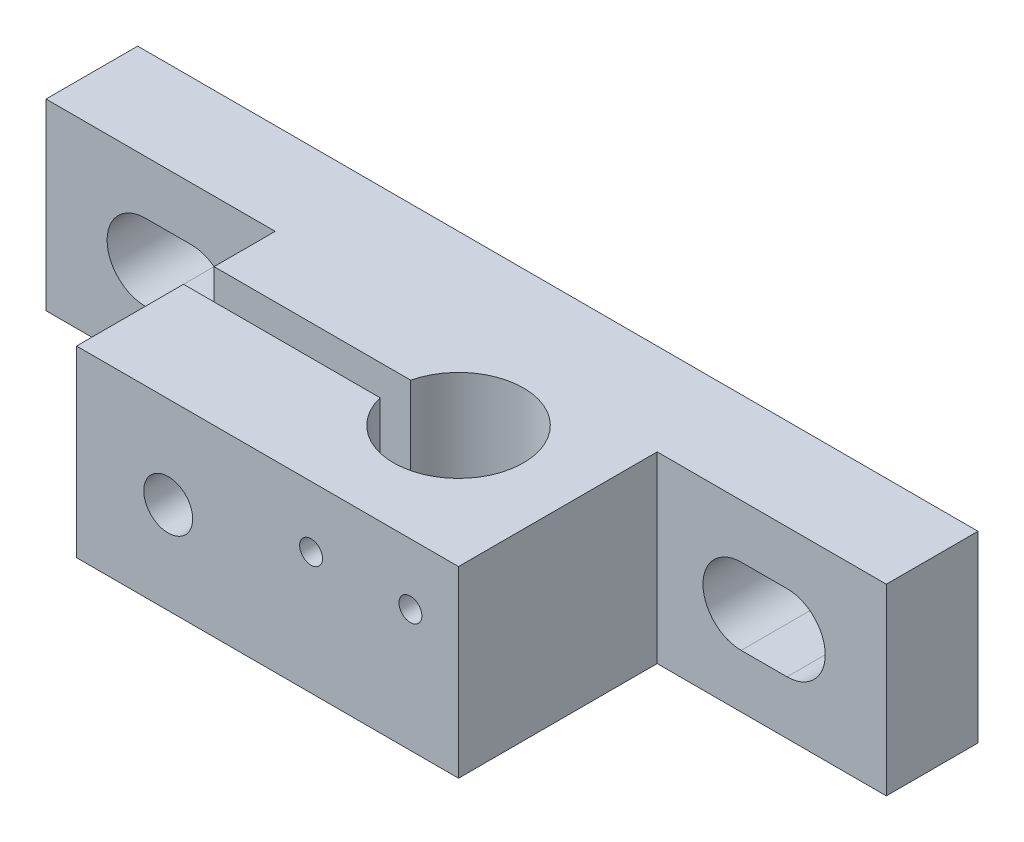
ISO-10303-21;
HEADER;
FILE_DESCRIPTION(('STEP AP214'),'2;1');
FILE_NAME('part.step','',(''),(''),'','','');
FILE_SCHEMA(('AUTOMOTIVE_DESIGN { 1 0 10303 214 1 1 1 1 }'));
ENDSEC;
DATA;
#1=APPLICATION_CONTEXT('core data for automotive mechanical design processes');
#2=APPLICATION_PROTOCOL_DEFINITION('international standard','automotive_design',2000,#1);
#3=PRODUCT_CONTEXT('',#1,'mechanical');
#4=PRODUCT('Part','Part','',(#3));
#5=PRODUCT_RELATED_PRODUCT_CATEGORY('part','',(#4));
#6=PRODUCT_DEFINITION_FORMATION('','',#4);
#7=PRODUCT_DEFINITION_CONTEXT('part definition',#1,'design');
#8=PRODUCT_DEFINITION('design','',#6,#7);
#9=PRODUCT_DEFINITION_SHAPE('','',#8);
#10=(LENGTH_UNIT() NAMED_UNIT(*) SI_UNIT(.MILLI.,.METRE.));
#11=(NAMED_UNIT(*) PLANE_ANGLE_UNIT() SI_UNIT($,.RADIAN.));
#12=(NAMED_UNIT(*) SI_UNIT($,.STERADIAN.) SOLID_ANGLE_UNIT());
#13=UNCERTAINTY_MEASURE_WITH_UNIT(LENGTH_MEASURE(1.E-05),#10,'distance_accuracy_value','');
#14=(GEOMETRIC_REPRESENTATION_CONTEXT(3) GLOBAL_UNCERTAINTY_ASSIGNED_CONTEXT((#13)) GLOBAL_UNIT_ASSIGNED_CONTEXT((#10,
#11,#12)) REPRESENTATION_CONTEXT('',''));
#15=CARTESIAN_POINT('',(0.,0.,0.));
#16=DIRECTION('',(0.,0.,1.));
#17=DIRECTION('',(1.,0.,0.));
#18=AXIS2_PLACEMENT_3D('',#15,#16,#17);
#19=CARTESIAN_POINT('',(15.,0.,19.));
#20=DIRECTION('',(1.,0.,0.));
#21=DIRECTION('',(0.,0.,-1.));
#22=AXIS2_PLACEMENT_3D('',#19,#20,#21);
#23=PLANE('',#22);
#24=DIRECTION('',(0.,0.,-1.));
#25=VECTOR('',#24,1.);
#26=CARTESIAN_POINT('',(15.,0.,19.));
#27=LINE('',#26,#25);
#28=CARTESIAN_POINT('',(15.,0.,10.));
#29=VERTEX_POINT('',#28);
#30=CARTESIAN_POINT('',(15.,0.,6.));
#31=VERTEX_POINT('',#30);
#32=EDGE_CURVE('E375',#29,#31,#27,.T.);
#33=ORIENTED_EDGE('',*,*,#32,.F.);
#34=DIRECTION('',(0.,1.,0.));
#35=VECTOR('',#34,1.);
#36=CARTESIAN_POINT('',(15.,0.,10.));
#37=LINE('',#36,#35);
#38=CARTESIAN_POINT('',(15.,12.,10.));
#39=VERTEX_POINT('',#38);
#40=EDGE_CURVE('E42',#29,#39,#37,.T.);
#41=ORIENTED_EDGE('',*,*,#40,.T.);
#42=DIRECTION('',(0.,0.,-1.));
#43=VECTOR('',#42,1.);
#44=CARTESIAN_POINT('',(15.,12.,19.));
#45=LINE('',#44,#43);
#46=CARTESIAN_POINT('',(15.,12.,6.));
#47=VERTEX_POINT('',#46);
#48=EDGE_CURVE('E358',#39,#47,#45,.T.);
#49=ORIENTED_EDGE('',*,*,#48,.T.);
#50=DIRECTION('',(0.,-1.,0.));
#51=VECTOR('',#50,1.);
#52=CARTESIAN_POINT('',(15.,0.,6.));
#53=LINE('',#52,#51);
#54=EDGE_CURVE('E347',#47,#31,#53,.T.);
#55=ORIENTED_EDGE('',*,*,#54,.T.);
#56=EDGE_LOOP('',(#33,#41,#49,#55));
#57=FACE_BOUND('',#56,.T.);
#58=ADVANCED_FACE('F33',(#57),#23,.F.);
#59=CARTESIAN_POINT('',(0.,0.,6.));
#60=DIRECTION('',(0.,0.,-1.));
#61=DIRECTION('',(-1.,0.,0.));
#62=AXIS2_PLACEMENT_3D('',#59,#60,#61);
#63=PLANE('',#62);
#64=CARTESIAN_POINT('',(6.5,6.,6.));
#65=DIRECTION('',(0.,0.,1.));
#66=DIRECTION('',(1.,0.,0.));
#67=AXIS2_PLACEMENT_3D('',#64,#65,#66);
#68=CIRCLE('',#67,2.50000000000001);
#69=CARTESIAN_POINT('',(6.5,8.5,6.));
#70=VERTEX_POINT('',#69);
#71=CARTESIAN_POINT('',(6.5,3.49999999999999,6.));
#72=VERTEX_POINT('',#71);
#73=EDGE_CURVE('E453',#70,#72,#68,.T.);
#74=ORIENTED_EDGE('',*,*,#73,.F.);
#75=DIRECTION('',(-1.,0.,0.));
#76=VECTOR('',#75,1.);
#77=CARTESIAN_POINT('',(6.5,8.5,6.));
#78=LINE('',#77,#76);
#79=CARTESIAN_POINT('',(9.5,8.5,6.));
#80=VERTEX_POINT('',#79);
#81=EDGE_CURVE('E449',#80,#70,#78,.T.);
#82=ORIENTED_EDGE('',*,*,#81,.F.);
#83=CARTESIAN_POINT('',(9.5,6.,6.));
#84=DIRECTION('',(0.,0.,1.));
#85=DIRECTION('',(1.,0.,0.));
#86=AXIS2_PLACEMENT_3D('',#83,#84,#85);
#87=CIRCLE('',#86,2.50000000000001);
#88=CARTESIAN_POINT('',(9.49999999999999,3.49999999999999,6.));
#89=VERTEX_POINT('',#88);
#90=EDGE_CURVE('E465',#89,#80,#87,.T.);
#91=ORIENTED_EDGE('',*,*,#90,.F.);
#92=DIRECTION('',(1.,0.,0.));
#93=VECTOR('',#92,1.);
#94=CARTESIAN_POINT('',(6.5,3.49999999999999,6.));
#95=LINE('',#94,#93);
#96=EDGE_CURVE('E468',#72,#89,#95,.T.);
#97=ORIENTED_EDGE('',*,*,#96,.F.);
#98=EDGE_LOOP('',(#74,#82,#91,#97));
#99=FACE_BOUND('',#98,.T.);
#100=ORIENTED_EDGE('',*,*,#54,.F.);
#101=DIRECTION('',(-1.,0.,0.));
#102=VECTOR('',#101,1.);
#103=CARTESIAN_POINT('',(0.,12.,6.));
#104=LINE('',#103,#102);
#105=CARTESIAN_POINT('',(0.,12.,6.));
#106=VERTEX_POINT('',#105);
#107=EDGE_CURVE('E394',#47,#106,#104,.T.);
#108=ORIENTED_EDGE('',*,*,#107,.T.);
#109=DIRECTION('',(0.,-1.,0.));
#110=VECTOR('',#109,1.);
#111=CARTESIAN_POINT('',(0.,0.,6.));
#112=LINE('',#111,#110);
#113=CARTESIAN_POINT('',(0.,0.,6.));
#114=VERTEX_POINT('',#113);
#115=EDGE_CURVE('E424',#106,#114,#112,.T.);
#116=ORIENTED_EDGE('',*,*,#115,.T.);
#117=DIRECTION('',(1.,0.,0.));
#118=VECTOR('',#117,1.);
#119=CARTESIAN_POINT('',(0.,0.,6.));
#120=LINE('',#119,#118);
#121=EDGE_CURVE('E404',#114,#31,#120,.T.);
#122=ORIENTED_EDGE('',*,*,#121,.T.);
#123=EDGE_LOOP('',(#100,#108,#116,#122));
#124=FACE_BOUND('',#123,.T.);
#125=ADVANCED_FACE('F534',(#99,#124),#63,.F.);
#126=CARTESIAN_POINT('',(48.5,6.00000000000001,6.));
#127=DIRECTION('',(0.,0.,1.));
#128=DIRECTION('',(-1.,0.,0.));
#129=AXIS2_PLACEMENT_3D('',#126,#127,#128);
#130=CIRCLE('',#129,2.50000000000001);
#131=CARTESIAN_POINT('',(48.5,3.49999999999999,6.));
#132=VERTEX_POINT('',#131);
#133=CARTESIAN_POINT('',(48.5,8.50000000000001,6.));
#134=VERTEX_POINT('',#133);
#135=EDGE_CURVE('E484',#132,#134,#130,.T.);
#136=ORIENTED_EDGE('',*,*,#135,.F.);
#137=DIRECTION('',(1.,0.,0.));
#138=VECTOR('',#137,1.);
#139=CARTESIAN_POINT('',(48.5,3.49999999999999,6.));
#140=LINE('',#139,#138);
#141=CARTESIAN_POINT('',(45.5,3.49999999999999,6.));
#142=VERTEX_POINT('',#141);
#143=EDGE_CURVE('E480',#142,#132,#140,.T.);
#144=ORIENTED_EDGE('',*,*,#143,.F.);
#145=CARTESIAN_POINT('',(45.5,6.,6.));
#146=DIRECTION('',(0.,0.,1.));
#147=DIRECTION('',(-1.,0.,0.));
#148=AXIS2_PLACEMENT_3D('',#145,#146,#147);
#149=CIRCLE('',#148,2.50000000000001);
#150=CARTESIAN_POINT('',(45.5,8.50000000000001,6.));
#151=VERTEX_POINT('',#150);
#152=EDGE_CURVE('E496',#151,#142,#149,.T.);
#153=ORIENTED_EDGE('',*,*,#152,.F.);
#154=DIRECTION('',(-1.,0.,0.));
#155=VECTOR('',#154,1.);
#156=CARTESIAN_POINT('',(48.5,8.50000000000001,6.));
#157=LINE('',#156,#155);
#158=EDGE_CURVE('E499',#134,#151,#157,.T.);
#159=ORIENTED_EDGE('',*,*,#158,.F.);
#160=EDGE_LOOP('',(#136,#144,#153,#159));
#161=FACE_BOUND('',#160,.T.);
#162=DIRECTION('',(0.,1.,0.));
#163=VECTOR('',#162,1.);
#164=CARTESIAN_POINT('',(40.,0.,6.));
#165=LINE('',#164,#163);
#166=CARTESIAN_POINT('',(40.,0.,6.));
#167=VERTEX_POINT('',#166);
#168=CARTESIAN_POINT('',(40.,12.,6.));
#169=VERTEX_POINT('',#168);
#170=EDGE_CURVE('E352',#167,#169,#165,.T.);
#171=ORIENTED_EDGE('',*,*,#170,.F.);
#172=CARTESIAN_POINT('',(55.,0.,6.));
#173=VERTEX_POINT('',#172);
#174=EDGE_CURVE('E435',#167,#173,#120,.T.);
#175=ORIENTED_EDGE('',*,*,#174,.T.);
#176=DIRECTION('',(0.,1.,0.));
#177=VECTOR('',#176,1.);
#178=CARTESIAN_POINT('',(55.,0.,6.));
#179=LINE('',#178,#177);
#180=CARTESIAN_POINT('',(55.,12.,6.));
#181=VERTEX_POINT('',#180);
#182=EDGE_CURVE('E401',#173,#181,#179,.T.);
#183=ORIENTED_EDGE('',*,*,#182,.T.);
#184=EDGE_CURVE('E400',#181,#169,#104,.T.);
#185=ORIENTED_EDGE('',*,*,#184,.T.);
#186=EDGE_LOOP('',(#171,#175,#183,#185));
#187=FACE_BOUND('',#186,.T.);
#188=ADVANCED_FACE('F512',(#161,#187),#63,.F.);
#189=CARTESIAN_POINT('',(0.,0.,0.));
#190=DIRECTION('',(0.,0.,-1.));
#191=DIRECTION('',(-1.,0.,0.));
#192=AXIS2_PLACEMENT_3D('',#189,#190,#191);
#193=PLANE('',#192);
#194=DIRECTION('',(0.,-1.,0.));
#195=VECTOR('',#194,1.);
#196=CARTESIAN_POINT('',(37.6724189772482,9.5,0.));
#197=LINE('',#196,#195);
#198=CARTESIAN_POINT('',(37.6724189772482,9.5,0.));
#199=VERTEX_POINT('',#198);
#200=CARTESIAN_POINT('',(37.6724189772482,2.5,0.));
#201=VERTEX_POINT('',#200);
#202=EDGE_CURVE('E57',#199,#201,#197,.T.);
#203=ORIENTED_EDGE('',*,*,#202,.F.);
#204=DIRECTION('',(1.,0.,0.));
#205=VECTOR('',#204,1.);
#206=CARTESIAN_POINT('',(37.6724189772482,9.5,0.));
#207=LINE('',#206,#205);
#208=CARTESIAN_POINT('',(17.15852847,9.5,0.));
#209=VERTEX_POINT('',#208);
#210=EDGE_CURVE('E303',#209,#199,#207,.T.);
#211=ORIENTED_EDGE('',*,*,#210,.F.);
#212=DIRECTION('',(0.,1.,0.));
#213=VECTOR('',#212,1.);
#214=CARTESIAN_POINT('',(17.15852847,9.5,0.));
#215=LINE('',#214,#213);
#216=CARTESIAN_POINT('',(17.15852847,2.5,0.));
#217=VERTEX_POINT('',#216);
#218=EDGE_CURVE('E317',#217,#209,#215,.T.);
#219=ORIENTED_EDGE('',*,*,#218,.F.);
#220=DIRECTION('',(-1.,0.,0.));
#221=VECTOR('',#220,1.);
#222=CARTESIAN_POINT('',(37.6724189772482,2.5,0.));
#223=LINE('',#222,#221);
#224=EDGE_CURVE('E314',#201,#217,#223,.T.);
#225=ORIENTED_EDGE('',*,*,#224,.F.);
#226=EDGE_LOOP('',(#203,#211,#219,#225));
#227=FACE_BOUND('',#226,.T.);
#228=DIRECTION('',(-1.,0.,0.));
#229=VECTOR('',#228,1.);
#230=CARTESIAN_POINT('',(6.5,8.5,0.));
#231=LINE('',#230,#229);
#232=CARTESIAN_POINT('',(9.5,8.5,0.));
#233=VERTEX_POINT('',#232);
#234=CARTESIAN_POINT('',(6.5,8.5,0.));
#235=VERTEX_POINT('',#234);
#236=EDGE_CURVE('E450',#233,#235,#231,.T.);
#237=ORIENTED_EDGE('',*,*,#236,.T.);
#238=CARTESIAN_POINT('',(6.5,6.,0.));
#239=DIRECTION('',(0.,0.,1.));
#240=DIRECTION('',(1.,0.,0.));
#241=AXIS2_PLACEMENT_3D('',#238,#239,#240);
#242=CIRCLE('',#241,2.50000000000001);
#243=CARTESIAN_POINT('',(6.5,3.49999999999999,0.));
#244=VERTEX_POINT('',#243);
#245=EDGE_CURVE('E460',#235,#244,#242,.T.);
#246=ORIENTED_EDGE('',*,*,#245,.T.);
#247=DIRECTION('',(1.,0.,0.));
#248=VECTOR('',#247,1.);
#249=CARTESIAN_POINT('',(6.5,3.49999999999999,0.));
#250=LINE('',#249,#248);
#251=CARTESIAN_POINT('',(9.49999999999999,3.49999999999999,0.));
#252=VERTEX_POINT('',#251);
#253=EDGE_CURVE('E457',#244,#252,#250,.T.);
#254=ORIENTED_EDGE('',*,*,#253,.T.);
#255=CARTESIAN_POINT('',(9.5,6.,0.));
#256=DIRECTION('',(0.,0.,1.));
#257=DIRECTION('',(1.,0.,0.));
#258=AXIS2_PLACEMENT_3D('',#255,#256,#257);
#259=CIRCLE('',#258,2.50000000000001);
#260=EDGE_CURVE('E454',#252,#233,#259,.T.);
#261=ORIENTED_EDGE('',*,*,#260,.T.);
#262=EDGE_LOOP('',(#237,#246,#254,#261));
#263=FACE_BOUND('',#262,.T.);
#264=DIRECTION('',(0.,-1.,0.));
#265=VECTOR('',#264,1.);
#266=CARTESIAN_POINT('',(0.,0.,0.));
#267=LINE('',#266,#265);
#268=CARTESIAN_POINT('',(0.,12.,0.));
#269=VERTEX_POINT('',#268);
#270=CARTESIAN_POINT('',(0.,0.,0.));
#271=VERTEX_POINT('',#270);
#272=EDGE_CURVE('E413',#269,#271,#267,.T.);
#273=ORIENTED_EDGE('',*,*,#272,.F.);
#274=DIRECTION('',(-1.,0.,0.));
#275=VECTOR('',#274,1.);
#276=CARTESIAN_POINT('',(0.,12.,0.));
#277=LINE('',#276,#275);
#278=CARTESIAN_POINT('',(55.,12.,0.));
#279=VERTEX_POINT('',#278);
#280=EDGE_CURVE('E422',#279,#269,#277,.T.);
#281=ORIENTED_EDGE('',*,*,#280,.F.);
#282=DIRECTION('',(0.,1.,0.));
#283=VECTOR('',#282,1.);
#284=CARTESIAN_POINT('',(55.,0.,0.));
#285=LINE('',#284,#283);
#286=CARTESIAN_POINT('',(55.,0.,0.));
#287=VERTEX_POINT('',#286);
#288=EDGE_CURVE('E420',#287,#279,#285,.T.);
#289=ORIENTED_EDGE('',*,*,#288,.F.);
#290=DIRECTION('',(1.,0.,0.));
#291=VECTOR('',#290,1.);
#292=CARTESIAN_POINT('',(0.,0.,0.));
#293=LINE('',#292,#291);
#294=EDGE_CURVE('E417',#271,#287,#293,.T.);
#295=ORIENTED_EDGE('',*,*,#294,.F.);
#296=EDGE_LOOP('',(#273,#281,#289,#295));
#297=FACE_BOUND('',#296,.T.);
#298=DIRECTION('',(1.,0.,0.));
#299=VECTOR('',#298,1.);
#300=CARTESIAN_POINT('',(48.5,3.49999999999999,0.));
#301=LINE('',#300,#299);
#302=CARTESIAN_POINT('',(45.5,3.5,0.));
#303=VERTEX_POINT('',#302);
#304=CARTESIAN_POINT('',(48.5,3.49999999999999,0.));
#305=VERTEX_POINT('',#304);
#306=EDGE_CURVE('E481',#303,#305,#301,.T.);
#307=ORIENTED_EDGE('',*,*,#306,.T.);
#308=CARTESIAN_POINT('',(48.5,6.00000000000001,0.));
#309=DIRECTION('',(0.,0.,1.));
#310=DIRECTION('',(-1.,0.,0.));
#311=AXIS2_PLACEMENT_3D('',#308,#309,#310);
#312=CIRCLE('',#311,2.50000000000001);
#313=CARTESIAN_POINT('',(48.5,8.50000000000001,0.));
#314=VERTEX_POINT('',#313);
#315=EDGE_CURVE('E491',#305,#314,#312,.T.);
#316=ORIENTED_EDGE('',*,*,#315,.T.);
#317=DIRECTION('',(-1.,0.,0.));
#318=VECTOR('',#317,1.);
#319=CARTESIAN_POINT('',(48.5,8.50000000000001,0.));
#320=LINE('',#319,#318);
#321=CARTESIAN_POINT('',(45.5,8.50000000000001,0.));
#322=VERTEX_POINT('',#321);
#323=EDGE_CURVE('E488',#314,#322,#320,.T.);
#324=ORIENTED_EDGE('',*,*,#323,.T.);
#325=CARTESIAN_POINT('',(45.5,6.,0.));
#326=DIRECTION('',(0.,0.,1.));
#327=DIRECTION('',(-1.,0.,0.));
#328=AXIS2_PLACEMENT_3D('',#325,#326,#327);
#329=CIRCLE('',#328,2.50000000000001);
#330=EDGE_CURVE('E485',#322,#303,#329,.T.);
#331=ORIENTED_EDGE('',*,*,#330,.T.);
#332=EDGE_LOOP('',(#307,#316,#324,#331));
#333=FACE_BOUND('',#332,.T.);
#334=ADVANCED_FACE('F519',(#227,#263,#297,#333),#193,.T.);
#335=CARTESIAN_POINT('',(0.,0.,6.));
#336=DIRECTION('',(1.,0.,0.));
#337=DIRECTION('',(0.,0.,-1.));
#338=AXIS2_PLACEMENT_3D('',#335,#336,#337);
#339=PLANE('',#338);
#340=ORIENTED_EDGE('',*,*,#272,.T.);
#341=DIRECTION('',(0.,0.,-1.));
#342=VECTOR('',#341,1.);
#343=CARTESIAN_POINT('',(0.,0.,6.));
#344=LINE('',#343,#342);
#345=EDGE_CURVE('E382',#114,#271,#344,.T.);
#346=ORIENTED_EDGE('',*,*,#345,.F.);
#347=ORIENTED_EDGE('',*,*,#115,.F.);
#348=DIRECTION('',(0.,0.,-1.));
#349=VECTOR('',#348,1.);
#350=CARTESIAN_POINT('',(0.,12.,6.));
#351=LINE('',#350,#349);
#352=EDGE_CURVE('E396',#106,#269,#351,.T.);
#353=ORIENTED_EDGE('',*,*,#352,.T.);
#354=EDGE_LOOP('',(#340,#346,#347,#353));
#355=FACE_BOUND('',#354,.T.);
#356=ADVANCED_FACE('F35',(#355),#339,.F.);
#357=CARTESIAN_POINT('',(0.,0.,6.));
#358=DIRECTION('',(0.,1.,0.));
#359=DIRECTION('',(0.,0.,1.));
#360=AXIS2_PLACEMENT_3D('',#357,#358,#359);
#361=PLANE('',#360);
#362=CARTESIAN_POINT('',(32.,0.,11.));
#363=DIRECTION('',(0.,-1.,0.));
#364=DIRECTION('',(0.,0.,-1.));
#365=AXIS2_PLACEMENT_3D('',#362,#363,#364);
#366=CIRCLE('',#365,4.25000000000001);
#367=CARTESIAN_POINT('',(27.8693220895354,0.,10.));
#368=VERTEX_POINT('',#367);
#369=CARTESIAN_POINT('',(27.8693220895354,0.,12.));
#370=VERTEX_POINT('',#369);
#371=EDGE_CURVE('E332',#368,#370,#366,.T.);
#372=ORIENTED_EDGE('',*,*,#371,.F.);
#373=DIRECTION('',(1.,0.,0.));
#374=VECTOR('',#373,1.);
#375=CARTESIAN_POINT('',(0.,0.,10.));
#376=LINE('',#375,#374);
#377=EDGE_CURVE('E324',#29,#368,#376,.T.);
#378=ORIENTED_EDGE('',*,*,#377,.F.);
#379=ORIENTED_EDGE('',*,*,#32,.T.);
#380=ORIENTED_EDGE('',*,*,#121,.F.);
#381=ORIENTED_EDGE('',*,*,#345,.T.);
#382=ORIENTED_EDGE('',*,*,#294,.T.);
#383=DIRECTION('',(0.,0.,-1.));
#384=VECTOR('',#383,1.);
#385=CARTESIAN_POINT('',(55.,0.,6.));
#386=LINE('',#385,#384);
#387=EDGE_CURVE('E429',#173,#287,#386,.T.);
#388=ORIENTED_EDGE('',*,*,#387,.F.);
#389=ORIENTED_EDGE('',*,*,#174,.F.);
#390=DIRECTION('',(0.,0.,-1.));
#391=VECTOR('',#390,1.);
#392=CARTESIAN_POINT('',(40.,0.,19.));
#393=LINE('',#392,#391);
#394=CARTESIAN_POINT('',(40.,0.,19.));
#395=VERTEX_POINT('',#394);
#396=EDGE_CURVE('E647',#395,#167,#393,.T.);
#397=ORIENTED_EDGE('',*,*,#396,.F.);
#398=DIRECTION('',(1.,0.,0.));
#399=VECTOR('',#398,1.);
#400=CARTESIAN_POINT('',(15.,0.,19.));
#401=LINE('',#400,#399);
#402=CARTESIAN_POINT('',(15.,0.,19.));
#403=VERTEX_POINT('',#402);
#404=EDGE_CURVE('E351',#403,#395,#401,.T.);
#405=ORIENTED_EDGE('',*,*,#404,.F.);
#406=CARTESIAN_POINT('',(15.,0.,12.));
#407=VERTEX_POINT('',#406);
#408=EDGE_CURVE('E494',#403,#407,#27,.T.);
#409=ORIENTED_EDGE('',*,*,#408,.T.);
#410=DIRECTION('',(-1.,0.,0.));
#411=VECTOR('',#410,1.);
#412=CARTESIAN_POINT('',(0.,0.,12.));
#413=LINE('',#412,#411);
#414=EDGE_CURVE('E335',#370,#407,#413,.T.);
#415=ORIENTED_EDGE('',*,*,#414,.F.);
#416=EDGE_LOOP('',(#372,#378,#379,#380,#381,#382,#388,#389,#397,#405,#409,#415));
#417=FACE_BOUND('',#416,.T.);
#418=ADVANCED_FACE('F662',(#417),#361,.F.);
#419=CARTESIAN_POINT('',(55.,0.,6.));
#420=DIRECTION('',(-1.,0.,0.));
#421=DIRECTION('',(0.,0.,1.));
#422=AXIS2_PLACEMENT_3D('',#419,#420,#421);
#423=PLANE('',#422);
#424=ORIENTED_EDGE('',*,*,#288,.T.);
#425=DIRECTION('',(0.,0.,-1.));
#426=VECTOR('',#425,1.);
#427=CARTESIAN_POINT('',(55.,12.,6.));
#428=LINE('',#427,#426);
#429=EDGE_CURVE('E426',#181,#279,#428,.T.);
#430=ORIENTED_EDGE('',*,*,#429,.F.);
#431=ORIENTED_EDGE('',*,*,#182,.F.);
#432=ORIENTED_EDGE('',*,*,#387,.T.);
#433=EDGE_LOOP('',(#424,#430,#431,#432));
#434=FACE_BOUND('',#433,.T.);
#435=ADVANCED_FACE('F667',(#434),#423,.F.);
#436=CARTESIAN_POINT('',(0.,12.,6.));
#437=DIRECTION('',(0.,-1.,0.));
#438=DIRECTION('',(0.,0.,-1.));
#439=AXIS2_PLACEMENT_3D('',#436,#437,#438);
#440=PLANE('',#439);
#441=ORIENTED_EDGE('',*,*,#48,.F.);
#442=DIRECTION('',(1.,0.,0.));
#443=VECTOR('',#442,1.);
#444=CARTESIAN_POINT('',(0.,12.,10.));
#445=LINE('',#444,#443);
#446=CARTESIAN_POINT('',(27.8693220895354,12.,10.));
#447=VERTEX_POINT('',#446);
#448=EDGE_CURVE('E344',#39,#447,#445,.T.);
#449=ORIENTED_EDGE('',*,*,#448,.T.);
#450=CARTESIAN_POINT('',(32.,12.,11.));
#451=DIRECTION('',(0.,-1.,0.));
#452=DIRECTION('',(0.,0.,-1.));
#453=AXIS2_PLACEMENT_3D('',#450,#451,#452);
#454=CIRCLE('',#453,4.25000000000001);
#455=CARTESIAN_POINT('',(27.8693220895354,12.,12.));
#456=VERTEX_POINT('',#455);
#457=EDGE_CURVE('E11',#447,#456,#454,.T.);
#458=ORIENTED_EDGE('',*,*,#457,.T.);
#459=DIRECTION('',(-1.,0.,0.));
#460=VECTOR('',#459,1.);
#461=CARTESIAN_POINT('',(0.,12.,12.));
#462=LINE('',#461,#460);
#463=CARTESIAN_POINT('',(15.,12.,12.));
#464=VERTEX_POINT('',#463);
#465=EDGE_CURVE('E340',#456,#464,#462,.T.);
#466=ORIENTED_EDGE('',*,*,#465,.T.);
#467=CARTESIAN_POINT('',(15.,12.,19.));
#468=VERTEX_POINT('',#467);
#469=EDGE_CURVE('E369',#468,#464,#45,.T.);
#470=ORIENTED_EDGE('',*,*,#469,.F.);
#471=DIRECTION('',(-1.,0.,0.));
#472=VECTOR('',#471,1.);
#473=CARTESIAN_POINT('',(15.,12.,19.));
#474=LINE('',#473,#472);
#475=CARTESIAN_POINT('',(40.,12.,19.));
#476=VERTEX_POINT('',#475);
#477=EDGE_CURVE('E356',#476,#468,#474,.T.);
#478=ORIENTED_EDGE('',*,*,#477,.F.);
#479=DIRECTION('',(0.,0.,-1.));
#480=VECTOR('',#479,1.);
#481=CARTESIAN_POINT('',(40.,12.,19.));
#482=LINE('',#481,#480);
#483=EDGE_CURVE('E372',#476,#169,#482,.T.);
#484=ORIENTED_EDGE('',*,*,#483,.T.);
#485=ORIENTED_EDGE('',*,*,#184,.F.);
#486=ORIENTED_EDGE('',*,*,#429,.T.);
#487=ORIENTED_EDGE('',*,*,#280,.T.);
#488=ORIENTED_EDGE('',*,*,#352,.F.);
#489=ORIENTED_EDGE('',*,*,#107,.F.);
#490=EDGE_LOOP('',(#441,#449,#458,#466,#470,#478,#484,#485,#486,#487,#488,#489));
#491=FACE_BOUND('',#490,.T.);
#492=ADVANCED_FACE('F392',(#491),#440,.F.);
#493=CARTESIAN_POINT('',(6.5,6.,6.));
#494=DIRECTION('',(0.,0.,-1.));
#495=DIRECTION('',(-1.,0.,0.));
#496=AXIS2_PLACEMENT_3D('',#493,#494,#495);
#497=CYLINDRICAL_SURFACE('',#496,2.50000000000001);
#498=ORIENTED_EDGE('',*,*,#245,.F.);
#499=DIRECTION('',(0.,0.,-1.));
#500=VECTOR('',#499,1.);
#501=CARTESIAN_POINT('',(6.5,8.5,6.));
#502=LINE('',#501,#500);
#503=EDGE_CURVE('E446',#70,#235,#502,.T.);
#504=ORIENTED_EDGE('',*,*,#503,.F.);
#505=ORIENTED_EDGE('',*,*,#73,.T.);
#506=DIRECTION('',(0.,0.,-1.));
#507=VECTOR('',#506,1.);
#508=CARTESIAN_POINT('',(6.5,3.49999999999999,6.));
#509=LINE('',#508,#507);
#510=EDGE_CURVE('E418',#72,#244,#509,.T.);
#511=ORIENTED_EDGE('',*,*,#510,.T.);
#512=EDGE_LOOP('',(#498,#504,#505,#511));
#513=FACE_BOUND('',#512,.T.);
#514=ADVANCED_FACE('F691',(#513),#497,.F.);
#515=CARTESIAN_POINT('',(6.5,3.49999999999999,6.));
#516=DIRECTION('',(0.,1.,0.));
#517=DIRECTION('',(0.,0.,1.));
#518=AXIS2_PLACEMENT_3D('',#515,#516,#517);
#519=PLANE('',#518);
#520=ORIENTED_EDGE('',*,*,#253,.F.);
#521=ORIENTED_EDGE('',*,*,#510,.F.);
#522=ORIENTED_EDGE('',*,*,#96,.T.);
#523=DIRECTION('',(0.,0.,-1.));
#524=VECTOR('',#523,1.);
#525=CARTESIAN_POINT('',(9.49999999999999,3.49999999999999,6.));
#526=LINE('',#525,#524);
#527=EDGE_CURVE('E442',#89,#252,#526,.T.);
#528=ORIENTED_EDGE('',*,*,#527,.T.);
#529=EDGE_LOOP('',(#520,#521,#522,#528));
#530=FACE_BOUND('',#529,.T.);
#531=ADVANCED_FACE('F708',(#530),#519,.T.);
#532=CARTESIAN_POINT('',(9.5,6.,6.));
#533=DIRECTION('',(0.,0.,-1.));
#534=DIRECTION('',(-1.,0.,0.));
#535=AXIS2_PLACEMENT_3D('',#532,#533,#534);
#536=CYLINDRICAL_SURFACE('',#535,2.50000000000001);
#537=ORIENTED_EDGE('',*,*,#260,.F.);
#538=ORIENTED_EDGE('',*,*,#527,.F.);
#539=ORIENTED_EDGE('',*,*,#90,.T.);
#540=DIRECTION('',(0.,0.,-1.));
#541=VECTOR('',#540,1.);
#542=CARTESIAN_POINT('',(9.5,8.5,6.));
#543=LINE('',#542,#541);
#544=EDGE_CURVE('E444',#80,#233,#543,.T.);
#545=ORIENTED_EDGE('',*,*,#544,.T.);
#546=EDGE_LOOP('',(#537,#538,#539,#545));
#547=FACE_BOUND('',#546,.T.);
#548=ADVANCED_FACE('F715',(#547),#536,.F.);
#549=CARTESIAN_POINT('',(6.5,8.5,6.));
#550=DIRECTION('',(0.,-1.,0.));
#551=DIRECTION('',(0.,0.,-1.));
#552=AXIS2_PLACEMENT_3D('',#549,#550,#551);
#553=PLANE('',#552);
#554=ORIENTED_EDGE('',*,*,#236,.F.);
#555=ORIENTED_EDGE('',*,*,#544,.F.);
#556=ORIENTED_EDGE('',*,*,#81,.T.);
#557=ORIENTED_EDGE('',*,*,#503,.T.);
#558=EDGE_LOOP('',(#554,#555,#556,#557));
#559=FACE_BOUND('',#558,.T.);
#560=ADVANCED_FACE('F723',(#559),#553,.T.);
#561=CARTESIAN_POINT('',(48.5,6.00000000000001,6.));
#562=DIRECTION('',(0.,0.,-1.));
#563=DIRECTION('',(-1.,0.,0.));
#564=AXIS2_PLACEMENT_3D('',#561,#562,#563);
#565=CYLINDRICAL_SURFACE('',#564,2.50000000000001);
#566=ORIENTED_EDGE('',*,*,#315,.F.);
#567=DIRECTION('',(0.,0.,-1.));
#568=VECTOR('',#567,1.);
#569=CARTESIAN_POINT('',(48.5,3.49999999999999,6.));
#570=LINE('',#569,#568);
#571=EDGE_CURVE('E477',#132,#305,#570,.T.);
#572=ORIENTED_EDGE('',*,*,#571,.F.);
#573=ORIENTED_EDGE('',*,*,#135,.T.);
#574=DIRECTION('',(0.,0.,-1.));
#575=VECTOR('',#574,1.);
#576=CARTESIAN_POINT('',(48.5,8.50000000000001,6.));
#577=LINE('',#576,#575);
#578=EDGE_CURVE('E463',#134,#314,#577,.T.);
#579=ORIENTED_EDGE('',*,*,#578,.T.);
#580=EDGE_LOOP('',(#566,#572,#573,#579));
#581=FACE_BOUND('',#580,.T.);
#582=ADVANCED_FACE('F504',(#581),#565,.F.);
#583=CARTESIAN_POINT('',(48.5,8.50000000000001,6.));
#584=DIRECTION('',(0.,-1.,0.));
#585=DIRECTION('',(0.,0.,-1.));
#586=AXIS2_PLACEMENT_3D('',#583,#584,#585);
#587=PLANE('',#586);
#588=ORIENTED_EDGE('',*,*,#323,.F.);
#589=ORIENTED_EDGE('',*,*,#578,.F.);
#590=ORIENTED_EDGE('',*,*,#158,.T.);
#591=DIRECTION('',(0.,0.,-1.));
#592=VECTOR('',#591,1.);
#593=CARTESIAN_POINT('',(45.5,8.50000000000001,6.));
#594=LINE('',#593,#592);
#595=EDGE_CURVE('E473',#151,#322,#594,.T.);
#596=ORIENTED_EDGE('',*,*,#595,.T.);
#597=EDGE_LOOP('',(#588,#589,#590,#596));
#598=FACE_BOUND('',#597,.T.);
#599=ADVANCED_FACE('F509',(#598),#587,.T.);
#600=CARTESIAN_POINT('',(45.5,6.,6.));
#601=DIRECTION('',(0.,0.,-1.));
#602=DIRECTION('',(-1.,0.,0.));
#603=AXIS2_PLACEMENT_3D('',#600,#601,#602);
#604=CYLINDRICAL_SURFACE('',#603,2.50000000000001);
#605=ORIENTED_EDGE('',*,*,#330,.F.);
#606=ORIENTED_EDGE('',*,*,#595,.F.);
#607=ORIENTED_EDGE('',*,*,#152,.T.);
#608=DIRECTION('',(0.,0.,-1.));
#609=VECTOR('',#608,1.);
#610=CARTESIAN_POINT('',(45.5,3.5,6.));
#611=LINE('',#610,#609);
#612=EDGE_CURVE('E475',#142,#303,#611,.T.);
#613=ORIENTED_EDGE('',*,*,#612,.T.);
#614=EDGE_LOOP('',(#605,#606,#607,#613));
#615=FACE_BOUND('',#614,.T.);
#616=ADVANCED_FACE('F516',(#615),#604,.F.);
#617=CARTESIAN_POINT('',(48.5,3.49999999999999,6.));
#618=DIRECTION('',(0.,1.,0.));
#619=DIRECTION('',(-1.,0.,0.));
#620=AXIS2_PLACEMENT_3D('',#617,#618,#619);
#621=PLANE('',#620);
#622=ORIENTED_EDGE('',*,*,#306,.F.);
#623=ORIENTED_EDGE('',*,*,#612,.F.);
#624=ORIENTED_EDGE('',*,*,#143,.T.);
#625=ORIENTED_EDGE('',*,*,#571,.T.);
#626=EDGE_LOOP('',(#622,#623,#624,#625));
#627=FACE_BOUND('',#626,.T.);
#628=ADVANCED_FACE('F521',(#627),#621,.T.);
#629=ORIENTED_EDGE('',*,*,#469,.T.);
#630=DIRECTION('',(0.,-1.,0.));
#631=VECTOR('',#630,1.);
#632=CARTESIAN_POINT('',(15.,0.,12.));
#633=LINE('',#632,#631);
#634=EDGE_CURVE('E379',#464,#407,#633,.T.);
#635=ORIENTED_EDGE('',*,*,#634,.T.);
#636=ORIENTED_EDGE('',*,*,#408,.F.);
#637=DIRECTION('',(0.,-1.,0.));
#638=VECTOR('',#637,1.);
#639=CARTESIAN_POINT('',(15.,0.,19.));
#640=LINE('',#639,#638);
#641=EDGE_CURVE('E348',#468,#403,#640,.T.);
#642=ORIENTED_EDGE('',*,*,#641,.F.);
#643=EDGE_LOOP('',(#629,#635,#636,#642));
#644=FACE_BOUND('',#643,.T.);
#645=ADVANCED_FACE('F523',(#644),#23,.F.);
#646=CARTESIAN_POINT('',(40.,0.,19.));
#647=DIRECTION('',(-1.,0.,0.));
#648=DIRECTION('',(0.,0.,1.));
#649=AXIS2_PLACEMENT_3D('',#646,#647,#648);
#650=PLANE('',#649);
#651=ORIENTED_EDGE('',*,*,#170,.T.);
#652=ORIENTED_EDGE('',*,*,#483,.F.);
#653=DIRECTION('',(0.,1.,0.));
#654=VECTOR('',#653,1.);
#655=CARTESIAN_POINT('',(40.,0.,19.));
#656=LINE('',#655,#654);
#657=EDGE_CURVE('E354',#395,#476,#656,.T.);
#658=ORIENTED_EDGE('',*,*,#657,.F.);
#659=ORIENTED_EDGE('',*,*,#396,.T.);
#660=EDGE_LOOP('',(#651,#652,#658,#659));
#661=FACE_BOUND('',#660,.T.);
#662=ADVANCED_FACE('F529',(#661),#650,.F.);
#663=CARTESIAN_POINT('',(0.,0.,19.));
#664=DIRECTION('',(0.,0.,-1.));
#665=DIRECTION('',(-1.,0.,0.));
#666=AXIS2_PLACEMENT_3D('',#663,#664,#665);
#667=PLANE('',#666);
#668=CARTESIAN_POINT('',(30.35,7.99999999999995,19.));
#669=DIRECTION('',(0.,0.,1.));
#670=DIRECTION('',(1.,0.,0.));
#671=AXIS2_PLACEMENT_3D('',#668,#669,#670);
#672=CIRCLE('',#671,0.749999999999999);
#673=CARTESIAN_POINT('',(31.1,7.99999999999995,19.));
#674=VERTEX_POINT('',#673);
#675=EDGE_CURVE('E626',#674,#674,#672,.T.);
#676=ORIENTED_EDGE('',*,*,#675,.F.);
#677=EDGE_LOOP('',(#676));
#678=FACE_BOUND('',#677,.T.);
#679=CARTESIAN_POINT('',(36.85,8.,19.));
#680=DIRECTION('',(0.,0.,1.));
#681=DIRECTION('',(1.,0.,0.));
#682=AXIS2_PLACEMENT_3D('',#679,#680,#681);
#683=CIRCLE('',#682,0.749999999999999);
#684=CARTESIAN_POINT('',(37.6,8.,19.));
#685=VERTEX_POINT('',#684);
#686=EDGE_CURVE('E259',#685,#685,#683,.T.);
#687=ORIENTED_EDGE('',*,*,#686,.F.);
#688=EDGE_LOOP('',(#687));
#689=FACE_BOUND('',#688,.T.);
#690=CARTESIAN_POINT('',(21.,6.,19.));
#691=DIRECTION('',(0.,0.,1.));
#692=DIRECTION('',(1.,0.,0.));
#693=AXIS2_PLACEMENT_3D('',#690,#691,#692);
#694=CIRCLE('',#693,1.6);
#695=CARTESIAN_POINT('',(22.6,6.,19.));
#696=VERTEX_POINT('',#695);
#697=EDGE_CURVE('E293',#696,#696,#694,.T.);
#698=ORIENTED_EDGE('',*,*,#697,.F.);
#699=EDGE_LOOP('',(#698));
#700=FACE_BOUND('',#699,.T.);
#701=ORIENTED_EDGE('',*,*,#641,.T.);
#702=ORIENTED_EDGE('',*,*,#404,.T.);
#703=ORIENTED_EDGE('',*,*,#657,.T.);
#704=ORIENTED_EDGE('',*,*,#477,.T.);
#705=EDGE_LOOP('',(#701,#702,#703,#704));
#706=FACE_BOUND('',#705,.T.);
#707=ADVANCED_FACE('F543',(#678,#689,#700,#706),#667,.F.);
#708=CARTESIAN_POINT('',(32.,30.,11.));
#709=DIRECTION('',(0.,-1.,0.));
#710=DIRECTION('',(0.,0.,-1.));
#711=AXIS2_PLACEMENT_3D('',#708,#709,#710);
#712=CYLINDRICAL_SURFACE('',#711,4.25000000000001);
#713=DIRECTION('',(0.,-1.,0.));
#714=VECTOR('',#713,1.);
#715=CARTESIAN_POINT('',(27.8693220895354,30.,10.));
#716=LINE('',#715,#714);
#717=EDGE_CURVE('E337',#447,#368,#716,.T.);
#718=ORIENTED_EDGE('',*,*,#717,.T.);
#719=ORIENTED_EDGE('',*,*,#371,.T.);
#720=DIRECTION('',(0.,-1.,0.));
#721=VECTOR('',#720,1.);
#722=CARTESIAN_POINT('',(27.8693220895354,30.,12.));
#723=LINE('',#722,#721);
#724=EDGE_CURVE('E338',#456,#370,#723,.T.);
#725=ORIENTED_EDGE('',*,*,#724,.F.);
#726=ORIENTED_EDGE('',*,*,#457,.F.);
#727=EDGE_LOOP('',(#718,#719,#725,#726));
#728=FACE_BOUND('',#727,.T.);
#729=ADVANCED_FACE('F547',(#728),#712,.F.);
#730=CARTESIAN_POINT('',(0.,30.,10.));
#731=DIRECTION('',(0.,0.,-1.));
#732=DIRECTION('',(-1.,0.,0.));
#733=AXIS2_PLACEMENT_3D('',#730,#731,#732);
#734=PLANE('',#733);
#735=CARTESIAN_POINT('',(21.,6.,10.));
#736=DIRECTION('',(0.,0.,-1.));
#737=DIRECTION('',(-1.,0.,0.));
#738=AXIS2_PLACEMENT_3D('',#735,#736,#737);
#739=CIRCLE('',#738,1.6);
#740=CARTESIAN_POINT('',(19.4,6.,10.));
#741=VERTEX_POINT('',#740);
#742=EDGE_CURVE('E296',#741,#741,#739,.T.);
#743=ORIENTED_EDGE('',*,*,#742,.T.);
#744=EDGE_LOOP('',(#743));
#745=FACE_BOUND('',#744,.T.);
#746=ORIENTED_EDGE('',*,*,#40,.F.);
#747=ORIENTED_EDGE('',*,*,#377,.T.);
#748=ORIENTED_EDGE('',*,*,#717,.F.);
#749=ORIENTED_EDGE('',*,*,#448,.F.);
#750=EDGE_LOOP('',(#746,#747,#748,#749));
#751=FACE_BOUND('',#750,.T.);
#752=ADVANCED_FACE('F549',(#745,#751),#734,.F.);
#753=CARTESIAN_POINT('',(0.,30.,12.));
#754=DIRECTION('',(0.,0.,1.));
#755=DIRECTION('',(1.,0.,0.));
#756=AXIS2_PLACEMENT_3D('',#753,#754,#755);
#757=PLANE('',#756);
#758=CARTESIAN_POINT('',(21.,6.,12.));
#759=DIRECTION('',(0.,0.,1.));
#760=DIRECTION('',(1.,0.,0.));
#761=AXIS2_PLACEMENT_3D('',#758,#759,#760);
#762=CIRCLE('',#761,1.6);
#763=CARTESIAN_POINT('',(22.6,6.,12.));
#764=VERTEX_POINT('',#763);
#765=EDGE_CURVE('E37',#764,#764,#762,.T.);
#766=ORIENTED_EDGE('',*,*,#765,.T.);
#767=EDGE_LOOP('',(#766));
#768=FACE_BOUND('',#767,.T.);
#769=ORIENTED_EDGE('',*,*,#724,.T.);
#770=ORIENTED_EDGE('',*,*,#414,.T.);
#771=ORIENTED_EDGE('',*,*,#634,.F.);
#772=ORIENTED_EDGE('',*,*,#465,.F.);
#773=EDGE_LOOP('',(#769,#770,#771,#772));
#774=FACE_BOUND('',#773,.T.);
#775=ADVANCED_FACE('F552',(#768,#774),#757,.F.);
#776=CARTESIAN_POINT('',(37.6724189772482,9.5,5.));
#777=DIRECTION('',(1.,0.,0.));
#778=DIRECTION('',(0.,0.,-1.));
#779=AXIS2_PLACEMENT_3D('',#776,#777,#778);
#780=PLANE('',#779);
#781=ORIENTED_EDGE('',*,*,#202,.T.);
#782=DIRECTION('',(0.,0.,-1.));
#783=VECTOR('',#782,1.);
#784=CARTESIAN_POINT('',(37.6724189772482,2.5,5.));
#785=LINE('',#784,#783);
#786=CARTESIAN_POINT('',(37.6724189772482,2.5,5.));
#787=VERTEX_POINT('',#786);
#788=EDGE_CURVE('E312',#787,#201,#785,.T.);
#789=ORIENTED_EDGE('',*,*,#788,.F.);
#790=DIRECTION('',(0.,-1.,0.));
#791=VECTOR('',#790,1.);
#792=CARTESIAN_POINT('',(37.6724189772482,9.5,5.));
#793=LINE('',#792,#791);
#794=CARTESIAN_POINT('',(37.6724189772482,9.5,5.));
#795=VERTEX_POINT('',#794);
#796=EDGE_CURVE('E299',#795,#787,#793,.T.);
#797=ORIENTED_EDGE('',*,*,#796,.F.);
#798=DIRECTION('',(0.,0.,-1.));
#799=VECTOR('',#798,1.);
#800=CARTESIAN_POINT('',(37.6724189772482,9.5,5.));
#801=LINE('',#800,#799);
#802=EDGE_CURVE('E322',#795,#199,#801,.T.);
#803=ORIENTED_EDGE('',*,*,#802,.T.);
#804=EDGE_LOOP('',(#781,#789,#797,#803));
#805=FACE_BOUND('',#804,.T.);
#806=ADVANCED_FACE('F559',(#805),#780,.F.);
#807=CARTESIAN_POINT('',(37.6724189772482,9.5,5.));
#808=DIRECTION('',(0.,1.,0.));
#809=DIRECTION('',(-1.,0.,0.));
#810=AXIS2_PLACEMENT_3D('',#807,#808,#809);
#811=PLANE('',#810);
#812=ORIENTED_EDGE('',*,*,#210,.T.);
#813=ORIENTED_EDGE('',*,*,#802,.F.);
#814=DIRECTION('',(1.,0.,0.));
#815=VECTOR('',#814,1.);
#816=CARTESIAN_POINT('',(37.6724189772482,9.5,5.));
#817=LINE('',#816,#815);
#818=CARTESIAN_POINT('',(17.15852847,9.5,5.));
#819=VERTEX_POINT('',#818);
#820=EDGE_CURVE('E309',#819,#795,#817,.T.);
#821=ORIENTED_EDGE('',*,*,#820,.F.);
#822=DIRECTION('',(0.,0.,-1.));
#823=VECTOR('',#822,1.);
#824=CARTESIAN_POINT('',(17.15852847,9.5,5.));
#825=LINE('',#824,#823);
#826=EDGE_CURVE('E325',#819,#209,#825,.T.);
#827=ORIENTED_EDGE('',*,*,#826,.T.);
#828=EDGE_LOOP('',(#812,#813,#821,#827));
#829=FACE_BOUND('',#828,.T.);
#830=ADVANCED_FACE('F563',(#829),#811,.F.);
#831=CARTESIAN_POINT('',(17.15852847,9.5,5.));
#832=DIRECTION('',(-1.,0.,0.));
#833=DIRECTION('',(0.,0.,1.));
#834=AXIS2_PLACEMENT_3D('',#831,#832,#833);
#835=PLANE('',#834);
#836=ORIENTED_EDGE('',*,*,#218,.T.);
#837=ORIENTED_EDGE('',*,*,#826,.F.);
#838=DIRECTION('',(0.,1.,0.));
#839=VECTOR('',#838,1.);
#840=CARTESIAN_POINT('',(17.15852847,9.5,5.));
#841=LINE('',#840,#839);
#842=CARTESIAN_POINT('',(17.15852847,2.5,5.));
#843=VERTEX_POINT('',#842);
#844=EDGE_CURVE('E306',#843,#819,#841,.T.);
#845=ORIENTED_EDGE('',*,*,#844,.F.);
#846=DIRECTION('',(0.,0.,-1.));
#847=VECTOR('',#846,1.);
#848=CARTESIAN_POINT('',(17.15852847,2.5,5.));
#849=LINE('',#848,#847);
#850=EDGE_CURVE('E327',#843,#217,#849,.T.);
#851=ORIENTED_EDGE('',*,*,#850,.T.);
#852=EDGE_LOOP('',(#836,#837,#845,#851));
#853=FACE_BOUND('',#852,.T.);
#854=ADVANCED_FACE('F568',(#853),#835,.F.);
#855=CARTESIAN_POINT('',(37.6724189772482,2.5,5.));
#856=DIRECTION('',(0.,-1.,0.));
#857=DIRECTION('',(1.,0.,0.));
#858=AXIS2_PLACEMENT_3D('',#855,#856,#857);
#859=PLANE('',#858);
#860=ORIENTED_EDGE('',*,*,#224,.T.);
#861=ORIENTED_EDGE('',*,*,#850,.F.);
#862=DIRECTION('',(-1.,0.,0.));
#863=VECTOR('',#862,1.);
#864=CARTESIAN_POINT('',(37.6724189772482,2.5,5.));
#865=LINE('',#864,#863);
#866=EDGE_CURVE('E302',#787,#843,#865,.T.);
#867=ORIENTED_EDGE('',*,*,#866,.F.);
#868=ORIENTED_EDGE('',*,*,#788,.T.);
#869=EDGE_LOOP('',(#860,#861,#867,#868));
#870=FACE_BOUND('',#869,.T.);
#871=ADVANCED_FACE('F564',(#870),#859,.F.);
#872=CARTESIAN_POINT('',(0.,0.,5.));
#873=DIRECTION('',(0.,0.,-1.));
#874=DIRECTION('',(-1.,0.,0.));
#875=AXIS2_PLACEMENT_3D('',#872,#873,#874);
#876=PLANE('',#875);
#877=DIRECTION('',(-0.5,0.866025403784439,0.));
#878=VECTOR('',#877,1.);
#879=CARTESIAN_POINT('',(19.2679491924311,2.99999999999999,5.));
#880=LINE('',#879,#878);
#881=CARTESIAN_POINT('',(19.2679491924311,2.99999999999999,5.));
#882=VERTEX_POINT('',#881);
#883=CARTESIAN_POINT('',(17.5358983848622,6.,5.));
#884=VERTEX_POINT('',#883);
#885=EDGE_CURVE('E49',#882,#884,#880,.T.);
#886=ORIENTED_EDGE('',*,*,#885,.F.);
#887=DIRECTION('',(-1.,0.,0.));
#888=VECTOR('',#887,1.);
#889=CARTESIAN_POINT('',(22.7320508075689,2.99999999999999,5.));
#890=LINE('',#889,#888);
#891=CARTESIAN_POINT('',(22.7320508075689,2.99999999999999,5.));
#892=VERTEX_POINT('',#891);
#893=EDGE_CURVE('E253',#892,#882,#890,.T.);
#894=ORIENTED_EDGE('',*,*,#893,.F.);
#895=DIRECTION('',(-0.5,-0.866025403784438,0.));
#896=VECTOR('',#895,1.);
#897=CARTESIAN_POINT('',(24.4641016151378,6.,5.));
#898=LINE('',#897,#896);
#899=CARTESIAN_POINT('',(24.4641016151378,6.,5.));
#900=VERTEX_POINT('',#899);
#901=EDGE_CURVE('E256',#900,#892,#898,.T.);
#902=ORIENTED_EDGE('',*,*,#901,.F.);
#903=DIRECTION('',(0.5,-0.866025403784439,0.));
#904=VECTOR('',#903,1.);
#905=CARTESIAN_POINT('',(22.7320508075689,9.00000000000001,5.));
#906=LINE('',#905,#904);
#907=CARTESIAN_POINT('',(22.7320508075689,9.00000000000001,5.));
#908=VERTEX_POINT('',#907);
#909=EDGE_CURVE('E276',#908,#900,#906,.T.);
#910=ORIENTED_EDGE('',*,*,#909,.F.);
#911=DIRECTION('',(1.,0.,0.));
#912=VECTOR('',#911,1.);
#913=CARTESIAN_POINT('',(19.2679491924311,9.00000000000001,5.));
#914=LINE('',#913,#912);
#915=CARTESIAN_POINT('',(19.2679491924311,9.00000000000001,5.));
#916=VERTEX_POINT('',#915);
#917=EDGE_CURVE('E273',#916,#908,#914,.T.);
#918=ORIENTED_EDGE('',*,*,#917,.F.);
#919=DIRECTION('',(0.499999999999999,0.866025403784439,0.));
#920=VECTOR('',#919,1.);
#921=CARTESIAN_POINT('',(17.5358983848622,6.,5.));
#922=LINE('',#921,#920);
#923=EDGE_CURVE('E270',#884,#916,#922,.T.);
#924=ORIENTED_EDGE('',*,*,#923,.F.);
#925=EDGE_LOOP('',(#886,#894,#902,#910,#918,#924));
#926=FACE_BOUND('',#925,.T.);
#927=ORIENTED_EDGE('',*,*,#796,.T.);
#928=ORIENTED_EDGE('',*,*,#866,.T.);
#929=ORIENTED_EDGE('',*,*,#844,.T.);
#930=ORIENTED_EDGE('',*,*,#820,.T.);
#931=EDGE_LOOP('',(#927,#928,#929,#930));
#932=FACE_BOUND('',#931,.T.);
#933=ADVANCED_FACE('F567',(#926,#932),#876,.T.);
#934=CARTESIAN_POINT('',(21.,6.,8.));
#935=DIRECTION('',(0.,0.,1.));
#936=DIRECTION('',(1.,0.,0.));
#937=AXIS2_PLACEMENT_3D('',#934,#935,#936);
#938=CYLINDRICAL_SURFACE('',#937,1.6);
#939=ORIENTED_EDGE('',*,*,#697,.T.);
#940=EDGE_LOOP('',(#939));
#941=FACE_BOUND('',#940,.T.);
#942=ORIENTED_EDGE('',*,*,#765,.F.);
#943=EDGE_LOOP('',(#942));
#944=FACE_BOUND('',#943,.T.);
#945=ADVANCED_FACE('F578',(#941,#944),#938,.F.);
#946=CARTESIAN_POINT('',(21.,6.,8.));
#947=DIRECTION('',(0.,0.,-1.));
#948=DIRECTION('',(-1.,0.,0.));
#949=AXIS2_PLACEMENT_3D('',#946,#947,#948);
#950=CIRCLE('',#949,1.6);
#951=CARTESIAN_POINT('',(19.4,6.,8.));
#952=VERTEX_POINT('',#951);
#953=EDGE_CURVE('E283',#952,#952,#950,.F.);
#954=ORIENTED_EDGE('',*,*,#953,.F.);
#955=EDGE_LOOP('',(#954));
#956=FACE_BOUND('',#955,.T.);
#957=ORIENTED_EDGE('',*,*,#742,.F.);
#958=EDGE_LOOP('',(#957));
#959=FACE_BOUND('',#958,.T.);
#960=ADVANCED_FACE('F580',(#956,#959),#938,.F.);
#961=CARTESIAN_POINT('',(0.,0.,8.));
#962=DIRECTION('',(0.,0.,-1.));
#963=DIRECTION('',(-1.,0.,0.));
#964=AXIS2_PLACEMENT_3D('',#961,#962,#963);
#965=PLANE('',#964);
#966=DIRECTION('',(-0.5,0.866025403784439,0.));
#967=VECTOR('',#966,1.);
#968=CARTESIAN_POINT('',(19.2679491924311,2.99999999999999,8.));
#969=LINE('',#968,#967);
#970=CARTESIAN_POINT('',(19.2679491924311,2.99999999999999,8.));
#971=VERTEX_POINT('',#970);
#972=CARTESIAN_POINT('',(17.5358983848622,6.,8.));
#973=VERTEX_POINT('',#972);
#974=EDGE_CURVE('E233',#971,#973,#969,.T.);
#975=ORIENTED_EDGE('',*,*,#974,.T.);
#976=DIRECTION('',(0.499999999999999,0.866025403784439,0.));
#977=VECTOR('',#976,1.);
#978=CARTESIAN_POINT('',(17.5358983848622,6.,8.));
#979=LINE('',#978,#977);
#980=CARTESIAN_POINT('',(19.2679491924311,9.00000000000001,8.));
#981=VERTEX_POINT('',#980);
#982=EDGE_CURVE('E242',#973,#981,#979,.T.);
#983=ORIENTED_EDGE('',*,*,#982,.T.);
#984=DIRECTION('',(1.,0.,0.));
#985=VECTOR('',#984,1.);
#986=CARTESIAN_POINT('',(19.2679491924311,9.00000000000001,8.));
#987=LINE('',#986,#985);
#988=CARTESIAN_POINT('',(22.7320508075689,9.00000000000001,8.));
#989=VERTEX_POINT('',#988);
#990=EDGE_CURVE('E247',#981,#989,#987,.T.);
#991=ORIENTED_EDGE('',*,*,#990,.T.);
#992=DIRECTION('',(0.5,-0.866025403784439,0.));
#993=VECTOR('',#992,1.);
#994=CARTESIAN_POINT('',(22.7320508075689,9.00000000000001,8.));
#995=LINE('',#994,#993);
#996=CARTESIAN_POINT('',(24.4641016151378,6.,8.));
#997=VERTEX_POINT('',#996);
#998=EDGE_CURVE('E263',#989,#997,#995,.T.);
#999=ORIENTED_EDGE('',*,*,#998,.T.);
#1000=DIRECTION('',(-0.5,-0.866025403784438,0.));
#1001=VECTOR('',#1000,1.);
#1002=CARTESIAN_POINT('',(24.4641016151378,6.,8.));
#1003=LINE('',#1002,#1001);
#1004=CARTESIAN_POINT('',(22.7320508075689,2.99999999999999,8.));
#1005=VERTEX_POINT('',#1004);
#1006=EDGE_CURVE('E266',#997,#1005,#1003,.T.);
#1007=ORIENTED_EDGE('',*,*,#1006,.T.);
#1008=DIRECTION('',(-1.,0.,0.));
#1009=VECTOR('',#1008,1.);
#1010=CARTESIAN_POINT('',(22.7320508075689,2.99999999999999,8.));
#1011=LINE('',#1010,#1009);
#1012=EDGE_CURVE('E239',#1005,#971,#1011,.T.);
#1013=ORIENTED_EDGE('',*,*,#1012,.T.);
#1014=EDGE_LOOP('',(#975,#983,#991,#999,#1007,#1013));
#1015=FACE_BOUND('',#1014,.T.);
#1016=ORIENTED_EDGE('',*,*,#953,.T.);
#1017=EDGE_LOOP('',(#1016));
#1018=FACE_BOUND('',#1017,.T.);
#1019=ADVANCED_FACE('F249',(#1015,#1018),#965,.T.);
#1020=CARTESIAN_POINT('',(19.2679491924311,2.99999999999999,8.));
#1021=DIRECTION('',(-0.866025403784439,-0.5,0.));
#1022=DIRECTION('',(0.5,-0.866025403784439,0.));
#1023=AXIS2_PLACEMENT_3D('',#1020,#1021,#1022);
#1024=PLANE('',#1023);
#1025=ORIENTED_EDGE('',*,*,#885,.T.);
#1026=DIRECTION('',(0.,0.,-1.));
#1027=VECTOR('',#1026,1.);
#1028=CARTESIAN_POINT('',(17.5358983848622,6.,8.));
#1029=LINE('',#1028,#1027);
#1030=EDGE_CURVE('E229',#973,#884,#1029,.T.);
#1031=ORIENTED_EDGE('',*,*,#1030,.F.);
#1032=ORIENTED_EDGE('',*,*,#974,.F.);
#1033=DIRECTION('',(0.,0.,-1.));
#1034=VECTOR('',#1033,1.);
#1035=CARTESIAN_POINT('',(19.2679491924311,2.99999999999999,8.));
#1036=LINE('',#1035,#1034);
#1037=EDGE_CURVE('E281',#971,#882,#1036,.T.);
#1038=ORIENTED_EDGE('',*,*,#1037,.T.);
#1039=EDGE_LOOP('',(#1025,#1031,#1032,#1038));
#1040=FACE_BOUND('',#1039,.T.);
#1041=ADVANCED_FACE('F231',(#1040),#1024,.F.);
#1042=CARTESIAN_POINT('',(22.7320508075689,2.99999999999999,8.));
#1043=DIRECTION('',(0.,-1.,0.));
#1044=DIRECTION('',(0.,0.,-1.));
#1045=AXIS2_PLACEMENT_3D('',#1042,#1043,#1044);
#1046=PLANE('',#1045);
#1047=ORIENTED_EDGE('',*,*,#893,.T.);
#1048=ORIENTED_EDGE('',*,*,#1037,.F.);
#1049=ORIENTED_EDGE('',*,*,#1012,.F.);
#1050=DIRECTION('',(0.,0.,-1.));
#1051=VECTOR('',#1050,1.);
#1052=CARTESIAN_POINT('',(22.7320508075689,2.99999999999999,8.));
#1053=LINE('',#1052,#1051);
#1054=EDGE_CURVE('E284',#1005,#892,#1053,.T.);
#1055=ORIENTED_EDGE('',*,*,#1054,.T.);
#1056=EDGE_LOOP('',(#1047,#1048,#1049,#1055));
#1057=FACE_BOUND('',#1056,.T.);
#1058=ADVANCED_FACE('F586',(#1057),#1046,.F.);
#1059=CARTESIAN_POINT('',(24.4641016151378,6.,8.));
#1060=DIRECTION('',(0.866025403784439,-0.5,0.));
#1061=DIRECTION('',(0.5,0.866025403784439,0.));
#1062=AXIS2_PLACEMENT_3D('',#1059,#1060,#1061);
#1063=PLANE('',#1062);
#1064=ORIENTED_EDGE('',*,*,#901,.T.);
#1065=ORIENTED_EDGE('',*,*,#1054,.F.);
#1066=ORIENTED_EDGE('',*,*,#1006,.F.);
#1067=DIRECTION('',(0.,0.,-1.));
#1068=VECTOR('',#1067,1.);
#1069=CARTESIAN_POINT('',(24.4641016151378,6.,8.));
#1070=LINE('',#1069,#1068);
#1071=EDGE_CURVE('E286',#997,#900,#1070,.T.);
#1072=ORIENTED_EDGE('',*,*,#1071,.T.);
#1073=EDGE_LOOP('',(#1064,#1065,#1066,#1072));
#1074=FACE_BOUND('',#1073,.T.);
#1075=ADVANCED_FACE('F597',(#1074),#1063,.F.);
#1076=CARTESIAN_POINT('',(22.7320508075689,9.00000000000001,8.));
#1077=DIRECTION('',(0.866025403784439,0.5,0.));
#1078=DIRECTION('',(-0.5,0.866025403784439,0.));
#1079=AXIS2_PLACEMENT_3D('',#1076,#1077,#1078);
#1080=PLANE('',#1079);
#1081=ORIENTED_EDGE('',*,*,#909,.T.);
#1082=ORIENTED_EDGE('',*,*,#1071,.F.);
#1083=ORIENTED_EDGE('',*,*,#998,.F.);
#1084=DIRECTION('',(0.,0.,-1.));
#1085=VECTOR('',#1084,1.);
#1086=CARTESIAN_POINT('',(22.7320508075689,9.00000000000001,8.));
#1087=LINE('',#1086,#1085);
#1088=EDGE_CURVE('E288',#989,#908,#1087,.T.);
#1089=ORIENTED_EDGE('',*,*,#1088,.T.);
#1090=EDGE_LOOP('',(#1081,#1082,#1083,#1089));
#1091=FACE_BOUND('',#1090,.T.);
#1092=ADVANCED_FACE('F593',(#1091),#1080,.F.);
#1093=CARTESIAN_POINT('',(19.2679491924311,9.00000000000001,8.));
#1094=DIRECTION('',(0.,1.,0.));
#1095=DIRECTION('',(0.,0.,1.));
#1096=AXIS2_PLACEMENT_3D('',#1093,#1094,#1095);
#1097=PLANE('',#1096);
#1098=ORIENTED_EDGE('',*,*,#917,.T.);
#1099=ORIENTED_EDGE('',*,*,#1088,.F.);
#1100=ORIENTED_EDGE('',*,*,#990,.F.);
#1101=DIRECTION('',(0.,0.,-1.));
#1102=VECTOR('',#1101,1.);
#1103=CARTESIAN_POINT('',(19.2679491924311,9.00000000000001,8.));
#1104=LINE('',#1103,#1102);
#1105=EDGE_CURVE('E238',#981,#916,#1104,.T.);
#1106=ORIENTED_EDGE('',*,*,#1105,.T.);
#1107=EDGE_LOOP('',(#1098,#1099,#1100,#1106));
#1108=FACE_BOUND('',#1107,.T.);
#1109=ADVANCED_FACE('F590',(#1108),#1097,.F.);
#1110=CARTESIAN_POINT('',(17.5358983848622,6.,8.));
#1111=DIRECTION('',(-0.866025403784439,0.5,0.));
#1112=DIRECTION('',(-0.5,-0.866025403784439,0.));
#1113=AXIS2_PLACEMENT_3D('',#1110,#1111,#1112);
#1114=PLANE('',#1113);
#1115=ORIENTED_EDGE('',*,*,#923,.T.);
#1116=ORIENTED_EDGE('',*,*,#1105,.F.);
#1117=ORIENTED_EDGE('',*,*,#982,.F.);
#1118=ORIENTED_EDGE('',*,*,#1030,.T.);
#1119=EDGE_LOOP('',(#1115,#1116,#1117,#1118));
#1120=FACE_BOUND('',#1119,.T.);
#1121=ADVANCED_FACE('F243',(#1120),#1114,.F.);
#1122=CARTESIAN_POINT('',(36.85,8.,16.));
#1123=DIRECTION('',(0.,0.,1.));
#1124=DIRECTION('',(1.,0.,0.));
#1125=AXIS2_PLACEMENT_3D('',#1122,#1123,#1124);
#1126=CYLINDRICAL_SURFACE('',#1125,0.749999999999999);
#1127=CARTESIAN_POINT('',(36.85,8.,16.));
#1128=DIRECTION('',(0.,0.,1.));
#1129=DIRECTION('',(1.,0.,0.));
#1130=AXIS2_PLACEMENT_3D('',#1127,#1128,#1129);
#1131=CIRCLE('',#1130,0.749999999999999);
#1132=CARTESIAN_POINT('',(37.6,8.,16.));
#1133=VERTEX_POINT('',#1132);
#1134=EDGE_CURVE('E271',#1133,#1133,#1131,.T.);
#1135=ORIENTED_EDGE('',*,*,#1134,.F.);
#1136=EDGE_LOOP('',(#1135));
#1137=FACE_BOUND('',#1136,.T.);
#1138=ORIENTED_EDGE('',*,*,#686,.T.);
#1139=EDGE_LOOP('',(#1138));
#1140=FACE_BOUND('',#1139,.T.);
#1141=ADVANCED_FACE('F589',(#1137,#1140),#1126,.F.);
#1142=CARTESIAN_POINT('',(36.85,8.,16.));
#1143=DIRECTION('',(0.,0.,1.));
#1144=DIRECTION('',(1.,0.,0.));
#1145=AXIS2_PLACEMENT_3D('',#1142,#1143,#1144);
#1146=PLANE('',#1145);
#1147=ORIENTED_EDGE('',*,*,#1134,.T.);
#1148=EDGE_LOOP('',(#1147));
#1149=FACE_BOUND('',#1148,.T.);
#1150=ADVANCED_FACE('F609',(#1149),#1146,.T.);
#1151=CARTESIAN_POINT('',(30.35,7.99999999999995,16.));
#1152=DIRECTION('',(0.,0.,1.));
#1153=DIRECTION('',(1.,0.,0.));
#1154=AXIS2_PLACEMENT_3D('',#1151,#1152,#1153);
#1155=CYLINDRICAL_SURFACE('',#1154,0.749999999999999);
#1156=CARTESIAN_POINT('',(30.35,7.99999999999995,16.));
#1157=DIRECTION('',(0.,0.,1.));
#1158=DIRECTION('',(1.,0.,0.));
#1159=AXIS2_PLACEMENT_3D('',#1156,#1157,#1158);
#1160=CIRCLE('',#1159,0.749999999999999);
#1161=CARTESIAN_POINT('',(31.1,7.99999999999995,16.));
#1162=VERTEX_POINT('',#1161);
#1163=EDGE_CURVE('E625',#1162,#1162,#1160,.T.);
#1164=ORIENTED_EDGE('',*,*,#1163,.F.);
#1165=EDGE_LOOP('',(#1164));
#1166=FACE_BOUND('',#1165,.T.);
#1167=ORIENTED_EDGE('',*,*,#675,.T.);
#1168=EDGE_LOOP('',(#1167));
#1169=FACE_BOUND('',#1168,.T.);
#1170=ADVANCED_FACE('F613',(#1166,#1169),#1155,.F.);
#1171=CARTESIAN_POINT('',(30.35,7.99999999999995,16.));
#1172=DIRECTION('',(0.,0.,1.));
#1173=DIRECTION('',(1.,0.,0.));
#1174=AXIS2_PLACEMENT_3D('',#1171,#1172,#1173);
#1175=PLANE('',#1174);
#1176=ORIENTED_EDGE('',*,*,#1163,.T.);
#1177=EDGE_LOOP('',(#1176));
#1178=FACE_BOUND('',#1177,.T.);
#1179=ADVANCED_FACE('F617',(#1178),#1175,.T.);
#1180=CLOSED_SHELL('',(#58,#125,#188,#334,#356,#418,#435,#492,#514,#531,#548,#560,#582,#599,
#616,#628,#645,#662,#707,#729,#752,#775,#806,#830,#854,#871,#933,#945,#960,#1019,#1041,#1058,
#1075,#1092,#1109,#1121,#1141,#1150,#1170,#1179));
#1181=MANIFOLD_SOLID_BREP('B2',#1180);
#1182=ADVANCED_BREP_SHAPE_REPRESENTATION('',(#18,#1181),#14);
#1183=SHAPE_DEFINITION_REPRESENTATION(#9,#1182);
ENDSEC;
END-ISO-10303-21;
